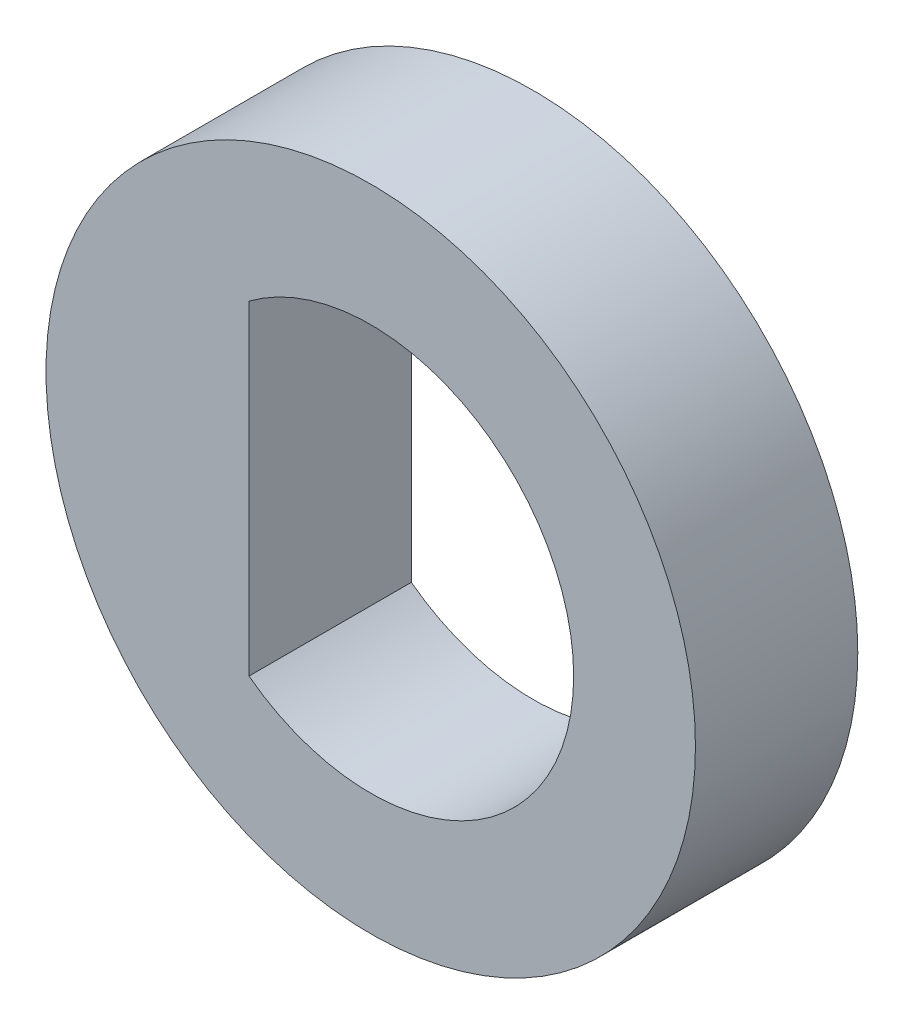
ISO-10303-21;
HEADER;
FILE_DESCRIPTION(('STEP AP214'),'2;1');
FILE_NAME('part.step','',(''),(''),'','','');
FILE_SCHEMA(('AUTOMOTIVE_DESIGN { 1 0 10303 214 1 1 1 1 }'));
ENDSEC;
DATA;
#1=APPLICATION_CONTEXT('core data for automotive mechanical design processes');
#2=APPLICATION_PROTOCOL_DEFINITION('international standard','automotive_design',2000,#1);
#3=PRODUCT_CONTEXT('',#1,'mechanical');
#4=PRODUCT('Part','Part','',(#3));
#5=PRODUCT_RELATED_PRODUCT_CATEGORY('part','',(#4));
#6=PRODUCT_DEFINITION_FORMATION('','',#4);
#7=PRODUCT_DEFINITION_CONTEXT('part definition',#1,'design');
#8=PRODUCT_DEFINITION('design','',#6,#7);
#9=PRODUCT_DEFINITION_SHAPE('','',#8);
#10=(LENGTH_UNIT() NAMED_UNIT(*) SI_UNIT(.MILLI.,.METRE.));
#11=(NAMED_UNIT(*) PLANE_ANGLE_UNIT() SI_UNIT($,.RADIAN.));
#12=(NAMED_UNIT(*) SI_UNIT($,.STERADIAN.) SOLID_ANGLE_UNIT());
#13=UNCERTAINTY_MEASURE_WITH_UNIT(LENGTH_MEASURE(1.E-05),#10,'distance_accuracy_value','');
#14=(GEOMETRIC_REPRESENTATION_CONTEXT(3) GLOBAL_UNCERTAINTY_ASSIGNED_CONTEXT((#13)) GLOBAL_UNIT_ASSIGNED_CONTEXT((#10,
#11,#12)) REPRESENTATION_CONTEXT('',''));
#15=CARTESIAN_POINT('',(0.,0.,0.));
#16=DIRECTION('',(0.,0.,1.));
#17=DIRECTION('',(1.,0.,0.));
#18=AXIS2_PLACEMENT_3D('',#15,#16,#17);
#19=CARTESIAN_POINT('',(0.,0.,2.));
#20=DIRECTION('',(0.,0.,1.));
#21=DIRECTION('',(1.,0.,0.));
#22=AXIS2_PLACEMENT_3D('',#19,#20,#21);
#23=PLANE('',#22);
#24=CARTESIAN_POINT('',(0.,0.,2.));
#25=DIRECTION('',(0.,0.,1.));
#26=DIRECTION('',(1.,0.,0.));
#27=AXIS2_PLACEMENT_3D('',#24,#25,#26);
#28=CIRCLE('',#27,4.);
#29=CARTESIAN_POINT('',(4.,0.,2.));
#30=VERTEX_POINT('',#29);
#31=EDGE_CURVE('E11',#30,#30,#28,.T.);
#32=ORIENTED_EDGE('',*,*,#31,.T.);
#33=EDGE_LOOP('',(#32));
#34=FACE_BOUND('',#33,.T.);
#35=DIRECTION('',(0.,-1.,0.));
#36=VECTOR('',#35,1.);
#37=CARTESIAN_POINT('',(-1.5,2.,2.));
#38=LINE('',#37,#36);
#39=CARTESIAN_POINT('',(-1.5,2.,2.));
#40=VERTEX_POINT('',#39);
#41=CARTESIAN_POINT('',(-1.5,-2.,2.));
#42=VERTEX_POINT('',#41);
#43=EDGE_CURVE('E88',#40,#42,#38,.T.);
#44=ORIENTED_EDGE('',*,*,#43,.F.);
#45=CARTESIAN_POINT('',(0.,0.,2.));
#46=DIRECTION('',(0.,0.,1.));
#47=DIRECTION('',(1.,0.,0.));
#48=AXIS2_PLACEMENT_3D('',#45,#46,#47);
#49=CIRCLE('',#48,2.5);
#50=EDGE_CURVE('E77',#42,#40,#49,.T.);
#51=ORIENTED_EDGE('',*,*,#50,.F.);
#52=EDGE_LOOP('',(#44,#51));
#53=FACE_BOUND('',#52,.T.);
#54=ADVANCED_FACE('F43',(#34,#53),#23,.T.);
#55=CARTESIAN_POINT('',(0.,0.,0.));
#56=DIRECTION('',(0.,0.,1.));
#57=DIRECTION('',(1.,0.,0.));
#58=AXIS2_PLACEMENT_3D('',#55,#56,#57);
#59=PLANE('',#58);
#60=CARTESIAN_POINT('',(0.,0.,0.));
#61=DIRECTION('',(0.,0.,1.));
#62=DIRECTION('',(1.,0.,0.));
#63=AXIS2_PLACEMENT_3D('',#60,#61,#62);
#64=CIRCLE('',#63,4.);
#65=CARTESIAN_POINT('',(4.,0.,0.));
#66=VERTEX_POINT('',#65);
#67=EDGE_CURVE('E47',#66,#66,#64,.T.);
#68=ORIENTED_EDGE('',*,*,#67,.F.);
#69=EDGE_LOOP('',(#68));
#70=FACE_BOUND('',#69,.T.);
#71=CARTESIAN_POINT('',(0.,0.,0.));
#72=DIRECTION('',(0.,0.,1.));
#73=DIRECTION('',(1.,0.,0.));
#74=AXIS2_PLACEMENT_3D('',#71,#72,#73);
#75=CIRCLE('',#74,2.5);
#76=CARTESIAN_POINT('',(-1.5,-2.,0.));
#77=VERTEX_POINT('',#76);
#78=CARTESIAN_POINT('',(-1.5,2.,0.));
#79=VERTEX_POINT('',#78);
#80=EDGE_CURVE('E66',#77,#79,#75,.T.);
#81=ORIENTED_EDGE('',*,*,#80,.T.);
#82=DIRECTION('',(0.,-1.,0.));
#83=VECTOR('',#82,1.);
#84=CARTESIAN_POINT('',(-1.5,2.,0.));
#85=LINE('',#84,#83);
#86=EDGE_CURVE('E72',#79,#77,#85,.T.);
#87=ORIENTED_EDGE('',*,*,#86,.T.);
#88=EDGE_LOOP('',(#81,#87));
#89=FACE_BOUND('',#88,.T.);
#90=ADVANCED_FACE('F84',(#70,#89),#59,.F.);
#91=CARTESIAN_POINT('',(0.,0.,2.));
#92=DIRECTION('',(0.,0.,-1.));
#93=DIRECTION('',(-1.,0.,0.));
#94=AXIS2_PLACEMENT_3D('',#91,#92,#93);
#95=CYLINDRICAL_SURFACE('',#94,4.);
#96=ORIENTED_EDGE('',*,*,#31,.F.);
#97=EDGE_LOOP('',(#96));
#98=FACE_BOUND('',#97,.T.);
#99=ORIENTED_EDGE('',*,*,#67,.T.);
#100=EDGE_LOOP('',(#99));
#101=FACE_BOUND('',#100,.T.);
#102=ADVANCED_FACE('F45',(#98,#101),#95,.T.);
#103=CARTESIAN_POINT('',(0.,0.,2.));
#104=DIRECTION('',(0.,0.,-1.));
#105=DIRECTION('',(-1.,0.,0.));
#106=AXIS2_PLACEMENT_3D('',#103,#104,#105);
#107=CYLINDRICAL_SURFACE('',#106,2.5);
#108=ORIENTED_EDGE('',*,*,#80,.F.);
#109=DIRECTION('',(0.,0.,-1.));
#110=VECTOR('',#109,1.);
#111=CARTESIAN_POINT('',(-1.5,-2.,2.));
#112=LINE('',#111,#110);
#113=EDGE_CURVE('E74',#42,#77,#112,.T.);
#114=ORIENTED_EDGE('',*,*,#113,.F.);
#115=ORIENTED_EDGE('',*,*,#50,.T.);
#116=DIRECTION('',(0.,0.,-1.));
#117=VECTOR('',#116,1.);
#118=CARTESIAN_POINT('',(-1.5,2.,2.));
#119=LINE('',#118,#117);
#120=EDGE_CURVE('E59',#40,#79,#119,.T.);
#121=ORIENTED_EDGE('',*,*,#120,.T.);
#122=EDGE_LOOP('',(#108,#114,#115,#121));
#123=FACE_BOUND('',#122,.T.);
#124=ADVANCED_FACE('F79',(#123),#107,.F.);
#125=CARTESIAN_POINT('',(-1.5,2.,2.));
#126=DIRECTION('',(1.,0.,0.));
#127=DIRECTION('',(0.,1.,0.));
#128=AXIS2_PLACEMENT_3D('',#125,#126,#127);
#129=PLANE('',#128);
#130=ORIENTED_EDGE('',*,*,#86,.F.);
#131=ORIENTED_EDGE('',*,*,#120,.F.);
#132=ORIENTED_EDGE('',*,*,#43,.T.);
#133=ORIENTED_EDGE('',*,*,#113,.T.);
#134=EDGE_LOOP('',(#130,#131,#132,#133));
#135=FACE_BOUND('',#134,.T.);
#136=ADVANCED_FACE('F73',(#135),#129,.T.);
#137=CLOSED_SHELL('',(#54,#90,#102,#124,#136));
#138=MANIFOLD_SOLID_BREP('B2',#137);
#139=ADVANCED_BREP_SHAPE_REPRESENTATION('',(#18,#138),#14);
#140=SHAPE_DEFINITION_REPRESENTATION(#9,#139);
ENDSEC;
END-ISO-10303-21;
